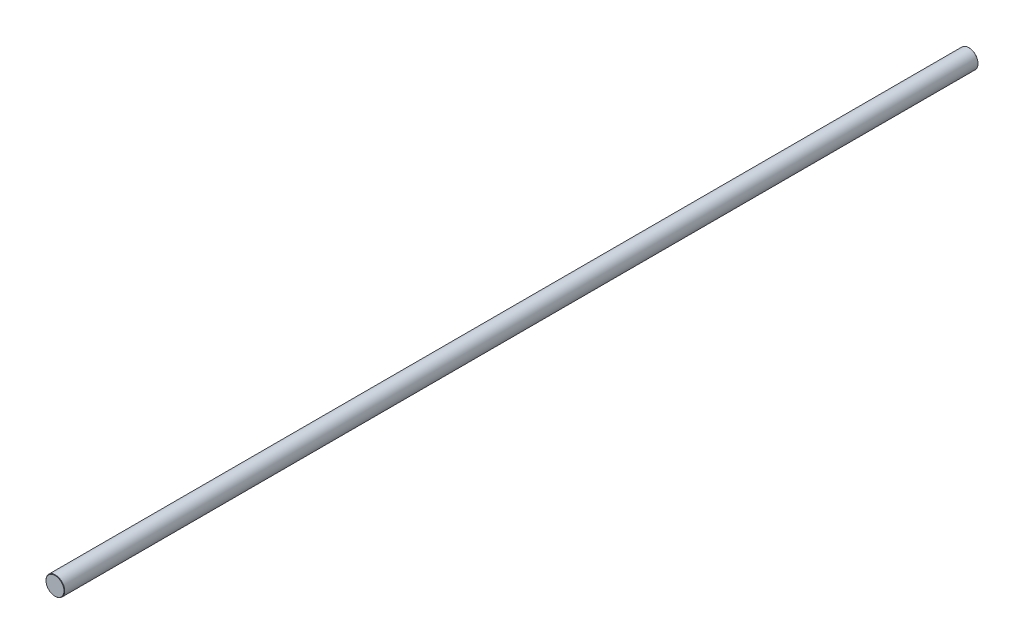
ISO-10303-21;
HEADER;
FILE_DESCRIPTION(('STEP AP214'),'2;1');
FILE_NAME('part.step','',(''),(''),'','','');
FILE_SCHEMA(('AUTOMOTIVE_DESIGN { 1 0 10303 214 1 1 1 1 }'));
ENDSEC;
DATA;
#1=APPLICATION_CONTEXT('core data for automotive mechanical design processes');
#2=APPLICATION_PROTOCOL_DEFINITION('international standard','automotive_design',2000,#1);
#3=PRODUCT_CONTEXT('',#1,'mechanical');
#4=PRODUCT('Part','Part','',(#3));
#5=PRODUCT_RELATED_PRODUCT_CATEGORY('part','',(#4));
#6=PRODUCT_DEFINITION_FORMATION('','',#4);
#7=PRODUCT_DEFINITION_CONTEXT('part definition',#1,'design');
#8=PRODUCT_DEFINITION('design','',#6,#7);
#9=PRODUCT_DEFINITION_SHAPE('','',#8);
#10=(LENGTH_UNIT() NAMED_UNIT(*) SI_UNIT(.MILLI.,.METRE.));
#11=(NAMED_UNIT(*) PLANE_ANGLE_UNIT() SI_UNIT($,.RADIAN.));
#12=(NAMED_UNIT(*) SI_UNIT($,.STERADIAN.) SOLID_ANGLE_UNIT());
#13=UNCERTAINTY_MEASURE_WITH_UNIT(LENGTH_MEASURE(1.E-05),#10,'distance_accuracy_value','');
#14=(GEOMETRIC_REPRESENTATION_CONTEXT(3) GLOBAL_UNCERTAINTY_ASSIGNED_CONTEXT((#13)) GLOBAL_UNIT_ASSIGNED_CONTEXT((#10,
#11,#12)) REPRESENTATION_CONTEXT('',''));
#15=CARTESIAN_POINT('',(0.,0.,0.));
#16=DIRECTION('',(0.,0.,1.));
#17=DIRECTION('',(1.,0.,0.));
#18=AXIS2_PLACEMENT_3D('',#15,#16,#17);
#19=CARTESIAN_POINT('',(0.,0.,610.));
#20=DIRECTION('',(0.,0.,-1.));
#21=DIRECTION('',(-1.,0.,0.));
#22=AXIS2_PLACEMENT_3D('',#19,#20,#21);
#23=CYLINDRICAL_SURFACE('',#22,12.5);
#24=CARTESIAN_POINT('',(0.,0.,-609.5));
#25=DIRECTION('',(0.,0.,1.));
#26=DIRECTION('',(1.,0.,0.));
#27=AXIS2_PLACEMENT_3D('',#24,#25,#26);
#28=CIRCLE('',#27,12.5);
#29=CARTESIAN_POINT('',(12.5,0.,-609.5));
#30=VERTEX_POINT('',#29);
#31=EDGE_CURVE('E54',#30,#30,#28,.T.);
#32=ORIENTED_EDGE('',*,*,#31,.T.);
#33=EDGE_LOOP('',(#32));
#34=FACE_BOUND('',#33,.T.);
#35=CARTESIAN_POINT('',(0.,0.,609.5));
#36=DIRECTION('',(0.,0.,1.));
#37=DIRECTION('',(1.,0.,0.));
#38=AXIS2_PLACEMENT_3D('',#35,#36,#37);
#39=CIRCLE('',#38,12.5);
#40=CARTESIAN_POINT('',(12.5,0.,609.5));
#41=VERTEX_POINT('',#40);
#42=EDGE_CURVE('E59',#41,#41,#39,.F.);
#43=ORIENTED_EDGE('',*,*,#42,.T.);
#44=EDGE_LOOP('',(#43));
#45=FACE_BOUND('',#44,.T.);
#46=ADVANCED_FACE('F41',(#34,#45),#23,.T.);
#47=CARTESIAN_POINT('',(0.,0.,610.));
#48=DIRECTION('',(0.,0.,1.));
#49=DIRECTION('',(1.,0.,0.));
#50=AXIS2_PLACEMENT_3D('',#47,#48,#49);
#51=PLANE('',#50);
#52=CARTESIAN_POINT('',(0.,0.,610.));
#53=DIRECTION('',(0.,0.,1.));
#54=DIRECTION('',(1.,0.,0.));
#55=AXIS2_PLACEMENT_3D('',#52,#53,#54);
#56=CIRCLE('',#55,11.9999999999998);
#57=CARTESIAN_POINT('',(11.9999999999998,0.,610.));
#58=VERTEX_POINT('',#57);
#59=EDGE_CURVE('E10',#58,#58,#56,.T.);
#60=ORIENTED_EDGE('',*,*,#59,.T.);
#61=EDGE_LOOP('',(#60));
#62=FACE_BOUND('',#61,.T.);
#63=ADVANCED_FACE('F76',(#62),#51,.T.);
#64=CARTESIAN_POINT('',(0.,0.,-610.));
#65=DIRECTION('',(0.,0.,1.));
#66=DIRECTION('',(1.,0.,0.));
#67=AXIS2_PLACEMENT_3D('',#64,#65,#66);
#68=PLANE('',#67);
#69=CARTESIAN_POINT('',(0.,0.,-610.));
#70=DIRECTION('',(0.,0.,1.));
#71=DIRECTION('',(1.,0.,0.));
#72=AXIS2_PLACEMENT_3D('',#69,#70,#71);
#73=CIRCLE('',#72,12.);
#74=CARTESIAN_POINT('',(12.,0.,-610.));
#75=VERTEX_POINT('',#74);
#76=EDGE_CURVE('E49',#75,#75,#73,.F.);
#77=ORIENTED_EDGE('',*,*,#76,.T.);
#78=EDGE_LOOP('',(#77));
#79=FACE_BOUND('',#78,.T.);
#80=ADVANCED_FACE('F73',(#79),#68,.F.);
#81=CARTESIAN_POINT('',(0.,0.,-609.5));
#82=DIRECTION('',(0.,0.,1.));
#83=DIRECTION('',(1.,0.,0.));
#84=AXIS2_PLACEMENT_3D('',#81,#82,#83);
#85=CONICAL_SURFACE('',#84,12.5,0.785398163397493);
#86=ORIENTED_EDGE('',*,*,#76,.F.);
#87=EDGE_LOOP('',(#86));
#88=FACE_BOUND('',#87,.T.);
#89=ORIENTED_EDGE('',*,*,#31,.F.);
#90=EDGE_LOOP('',(#89));
#91=FACE_BOUND('',#90,.T.);
#92=ADVANCED_FACE('F69',(#88,#91),#85,.T.);
#93=CARTESIAN_POINT('',(0.,0.,610.));
#94=DIRECTION('',(0.,0.,-1.));
#95=DIRECTION('',(-1.,0.,0.));
#96=AXIS2_PLACEMENT_3D('',#93,#94,#95);
#97=CONICAL_SURFACE('',#96,11.9999999999998,0.785398163397382);
#98=ORIENTED_EDGE('',*,*,#42,.F.);
#99=EDGE_LOOP('',(#98));
#100=FACE_BOUND('',#99,.T.);
#101=ORIENTED_EDGE('',*,*,#59,.F.);
#102=EDGE_LOOP('',(#101));
#103=FACE_BOUND('',#102,.T.);
#104=ADVANCED_FACE('F43',(#100,#103),#97,.T.);
#105=CLOSED_SHELL('',(#46,#63,#80,#92,#104));
#106=MANIFOLD_SOLID_BREP('B2',#105);
#107=ADVANCED_BREP_SHAPE_REPRESENTATION('',(#18,#106),#14);
#108=SHAPE_DEFINITION_REPRESENTATION(#9,#107);
ENDSEC;
END-ISO-10303-21;
